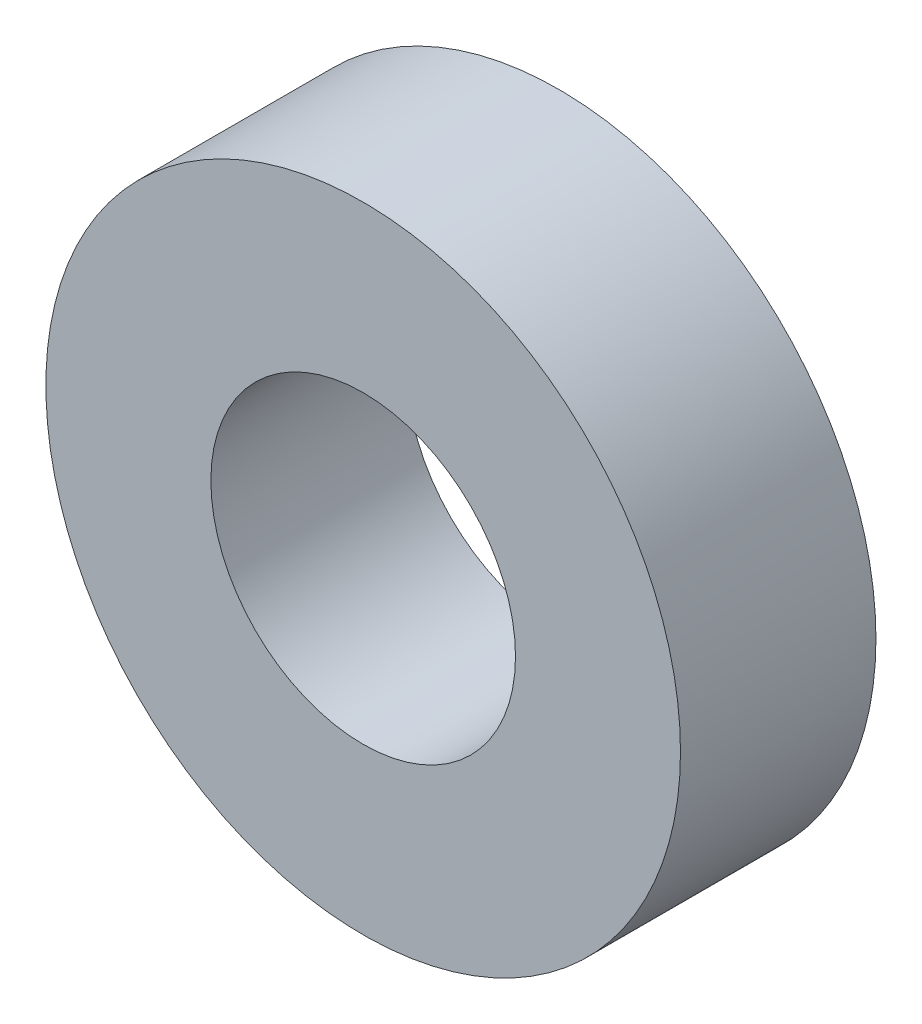
ISO-10303-21;
HEADER;
FILE_DESCRIPTION(('STEP AP214'),'2;1');
FILE_NAME('part.step','',(''),(''),'','','');
FILE_SCHEMA(('AUTOMOTIVE_DESIGN { 1 0 10303 214 1 1 1 1 }'));
ENDSEC;
DATA;
#1=APPLICATION_CONTEXT('core data for automotive mechanical design processes');
#2=APPLICATION_PROTOCOL_DEFINITION('international standard','automotive_design',2000,#1);
#3=PRODUCT_CONTEXT('',#1,'mechanical');
#4=PRODUCT('Part','Part','',(#3));
#5=PRODUCT_RELATED_PRODUCT_CATEGORY('part','',(#4));
#6=PRODUCT_DEFINITION_FORMATION('','',#4);
#7=PRODUCT_DEFINITION_CONTEXT('part definition',#1,'design');
#8=PRODUCT_DEFINITION('design','',#6,#7);
#9=PRODUCT_DEFINITION_SHAPE('','',#8);
#10=(LENGTH_UNIT() NAMED_UNIT(*) SI_UNIT(.MILLI.,.METRE.));
#11=(NAMED_UNIT(*) PLANE_ANGLE_UNIT() SI_UNIT($,.RADIAN.));
#12=(NAMED_UNIT(*) SI_UNIT($,.STERADIAN.) SOLID_ANGLE_UNIT());
#13=UNCERTAINTY_MEASURE_WITH_UNIT(LENGTH_MEASURE(1.E-05),#10,'distance_accuracy_value','');
#14=(GEOMETRIC_REPRESENTATION_CONTEXT(3) GLOBAL_UNCERTAINTY_ASSIGNED_CONTEXT((#13)) GLOBAL_UNIT_ASSIGNED_CONTEXT((#10,
#11,#12)) REPRESENTATION_CONTEXT('',''));
#15=CARTESIAN_POINT('',(0.,0.,0.));
#16=DIRECTION('',(0.,0.,1.));
#17=DIRECTION('',(1.,0.,0.));
#18=AXIS2_PLACEMENT_3D('',#15,#16,#17);
#19=CARTESIAN_POINT('',(0.,0.,-1.9558));
#20=DIRECTION('',(0.,0.,1.));
#21=DIRECTION('',(1.,0.,0.));
#22=AXIS2_PLACEMENT_3D('',#19,#20,#21);
#23=CYLINDRICAL_SURFACE('',#22,3.175);
#24=CARTESIAN_POINT('',(0.,0.,-1.9558));
#25=DIRECTION('',(0.,0.,1.));
#26=DIRECTION('',(1.,0.,0.));
#27=AXIS2_PLACEMENT_3D('',#24,#25,#26);
#28=CIRCLE('',#27,3.175);
#29=CARTESIAN_POINT('',(3.175,0.,-1.9558));
#30=VERTEX_POINT('',#29);
#31=EDGE_CURVE('E10',#30,#30,#28,.T.);
#32=ORIENTED_EDGE('',*,*,#31,.T.);
#33=EDGE_LOOP('',(#32));
#34=FACE_BOUND('',#33,.T.);
#35=CARTESIAN_POINT('',(0.,0.,0.));
#36=DIRECTION('',(0.,0.,1.));
#37=DIRECTION('',(1.,0.,0.));
#38=AXIS2_PLACEMENT_3D('',#35,#36,#37);
#39=CIRCLE('',#38,3.175);
#40=CARTESIAN_POINT('',(3.175,0.,0.));
#41=VERTEX_POINT('',#40);
#42=EDGE_CURVE('E33',#41,#41,#39,.T.);
#43=ORIENTED_EDGE('',*,*,#42,.F.);
#44=EDGE_LOOP('',(#43));
#45=FACE_BOUND('',#44,.T.);
#46=ADVANCED_FACE('F30',(#34,#45),#23,.T.);
#47=CARTESIAN_POINT('',(0.,0.,-1.9558));
#48=DIRECTION('',(0.,0.,1.));
#49=DIRECTION('',(1.,0.,0.));
#50=AXIS2_PLACEMENT_3D('',#47,#48,#49);
#51=PLANE('',#50);
#52=CARTESIAN_POINT('',(0.,0.,-1.9558));
#53=DIRECTION('',(0.,0.,1.));
#54=DIRECTION('',(1.,0.,0.));
#55=AXIS2_PLACEMENT_3D('',#52,#53,#54);
#56=CIRCLE('',#55,1.524);
#57=CARTESIAN_POINT('',(1.524,0.,-1.9558));
#58=VERTEX_POINT('',#57);
#59=EDGE_CURVE('E40',#58,#58,#56,.T.);
#60=ORIENTED_EDGE('',*,*,#59,.T.);
#61=EDGE_LOOP('',(#60));
#62=FACE_BOUND('',#61,.T.);
#63=ORIENTED_EDGE('',*,*,#31,.F.);
#64=EDGE_LOOP('',(#63));
#65=FACE_BOUND('',#64,.T.);
#66=ADVANCED_FACE('F48',(#62,#65),#51,.F.);
#67=CARTESIAN_POINT('',(0.,0.,0.));
#68=DIRECTION('',(0.,0.,1.));
#69=DIRECTION('',(1.,0.,0.));
#70=AXIS2_PLACEMENT_3D('',#67,#68,#69);
#71=PLANE('',#70);
#72=CARTESIAN_POINT('',(0.,0.,0.));
#73=DIRECTION('',(0.,0.,1.));
#74=DIRECTION('',(1.,0.,0.));
#75=AXIS2_PLACEMENT_3D('',#72,#73,#74);
#76=CIRCLE('',#75,1.524);
#77=CARTESIAN_POINT('',(1.524,0.,0.));
#78=VERTEX_POINT('',#77);
#79=EDGE_CURVE('E42',#78,#78,#76,.T.);
#80=ORIENTED_EDGE('',*,*,#79,.F.);
#81=EDGE_LOOP('',(#80));
#82=FACE_BOUND('',#81,.T.);
#83=ORIENTED_EDGE('',*,*,#42,.T.);
#84=EDGE_LOOP('',(#83));
#85=FACE_BOUND('',#84,.T.);
#86=ADVANCED_FACE('F54',(#82,#85),#71,.T.);
#87=CARTESIAN_POINT('',(0.,0.,-1.9558));
#88=DIRECTION('',(0.,0.,1.));
#89=DIRECTION('',(1.,0.,0.));
#90=AXIS2_PLACEMENT_3D('',#87,#88,#89);
#91=CYLINDRICAL_SURFACE('',#90,1.524);
#92=ORIENTED_EDGE('',*,*,#59,.F.);
#93=EDGE_LOOP('',(#92));
#94=FACE_BOUND('',#93,.T.);
#95=ORIENTED_EDGE('',*,*,#79,.T.);
#96=EDGE_LOOP('',(#95));
#97=FACE_BOUND('',#96,.T.);
#98=ADVANCED_FACE('F51',(#94,#97),#91,.F.);
#99=CLOSED_SHELL('',(#46,#66,#86,#98));
#100=MANIFOLD_SOLID_BREP('B2',#99);
#101=ADVANCED_BREP_SHAPE_REPRESENTATION('',(#18,#100),#14);
#102=SHAPE_DEFINITION_REPRESENTATION(#9,#101);
ENDSEC;
END-ISO-10303-21;
